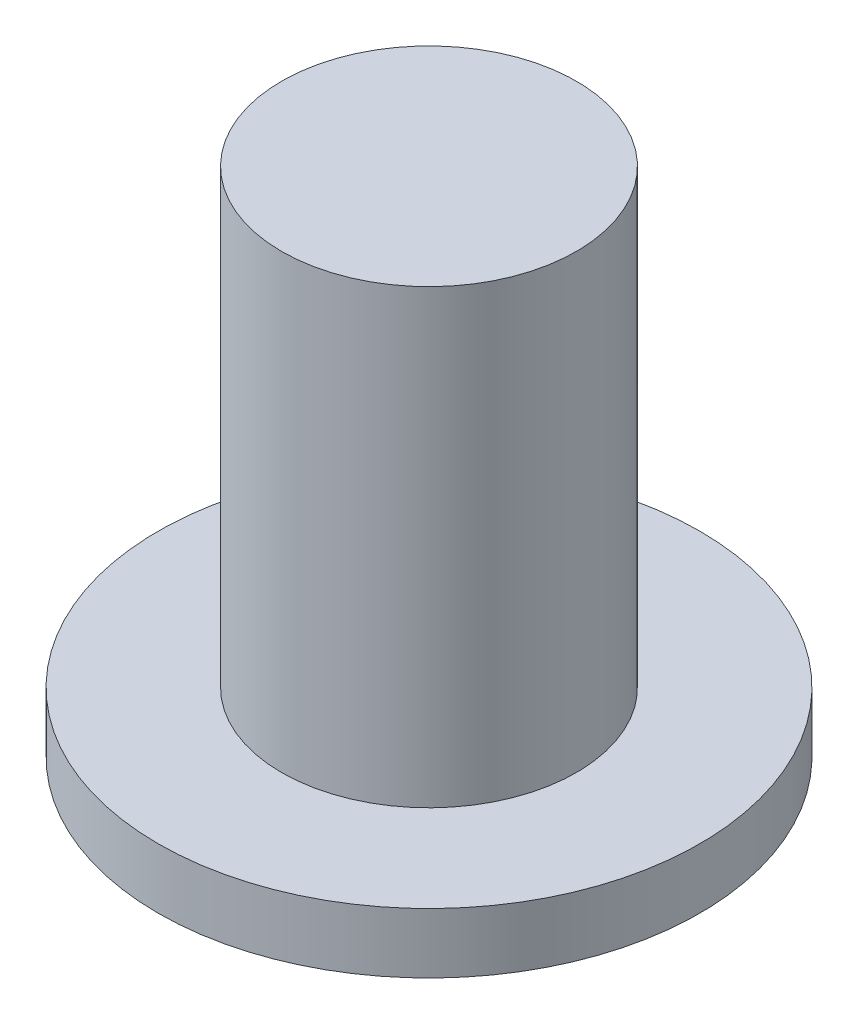
ISO-10303-21;
HEADER;
FILE_DESCRIPTION(('STEP AP214'),'2;1');
FILE_NAME('part.step','',(''),(''),'','','');
FILE_SCHEMA(('AUTOMOTIVE_DESIGN { 1 0 10303 214 1 1 1 1 }'));
ENDSEC;
DATA;
#1=APPLICATION_CONTEXT('core data for automotive mechanical design processes');
#2=APPLICATION_PROTOCOL_DEFINITION('international standard','automotive_design',2000,#1);
#3=PRODUCT_CONTEXT('',#1,'mechanical');
#4=PRODUCT('Part','Part','',(#3));
#5=PRODUCT_RELATED_PRODUCT_CATEGORY('part','',(#4));
#6=PRODUCT_DEFINITION_FORMATION('','',#4);
#7=PRODUCT_DEFINITION_CONTEXT('part definition',#1,'design');
#8=PRODUCT_DEFINITION('design','',#6,#7);
#9=PRODUCT_DEFINITION_SHAPE('','',#8);
#10=(LENGTH_UNIT() NAMED_UNIT(*) SI_UNIT(.MILLI.,.METRE.));
#11=(NAMED_UNIT(*) PLANE_ANGLE_UNIT() SI_UNIT($,.RADIAN.));
#12=(NAMED_UNIT(*) SI_UNIT($,.STERADIAN.) SOLID_ANGLE_UNIT());
#13=UNCERTAINTY_MEASURE_WITH_UNIT(LENGTH_MEASURE(1.E-05),#10,'distance_accuracy_value','');
#14=(GEOMETRIC_REPRESENTATION_CONTEXT(3) GLOBAL_UNCERTAINTY_ASSIGNED_CONTEXT((#13)) GLOBAL_UNIT_ASSIGNED_CONTEXT((#10,
#11,#12)) REPRESENTATION_CONTEXT('',''));
#15=CARTESIAN_POINT('',(0.,0.,0.));
#16=DIRECTION('',(0.,0.,1.));
#17=DIRECTION('',(1.,0.,0.));
#18=AXIS2_PLACEMENT_3D('',#15,#16,#17);
#19=CARTESIAN_POINT('',(0.,2.,0.));
#20=DIRECTION('',(0.,1.,0.));
#21=DIRECTION('',(0.,0.,1.));
#22=AXIS2_PLACEMENT_3D('',#19,#20,#21);
#23=PLANE('',#22);
#24=CARTESIAN_POINT('',(0.,2.,0.));
#25=DIRECTION('',(0.,1.,0.));
#26=DIRECTION('',(0.,0.,1.));
#27=AXIS2_PLACEMENT_3D('',#24,#25,#26);
#28=CIRCLE('',#27,9.);
#29=CARTESIAN_POINT('',(0.,2.,9.));
#30=VERTEX_POINT('',#29);
#31=EDGE_CURVE('E10',#30,#30,#28,.T.);
#32=ORIENTED_EDGE('',*,*,#31,.T.);
#33=EDGE_LOOP('',(#32));
#34=FACE_BOUND('',#33,.T.);
#35=CARTESIAN_POINT('',(0.,2.,0.));
#36=DIRECTION('',(0.,1.,0.));
#37=DIRECTION('',(0.,0.,1.));
#38=AXIS2_PLACEMENT_3D('',#35,#36,#37);
#39=CIRCLE('',#38,4.9);
#40=CARTESIAN_POINT('',(0.,2.,4.9));
#41=VERTEX_POINT('',#40);
#42=EDGE_CURVE('E48',#41,#41,#39,.T.);
#43=ORIENTED_EDGE('',*,*,#42,.F.);
#44=EDGE_LOOP('',(#43));
#45=FACE_BOUND('',#44,.T.);
#46=ADVANCED_FACE('F35',(#34,#45),#23,.T.);
#47=CARTESIAN_POINT('',(0.,2.,0.));
#48=DIRECTION('',(0.,-1.,0.));
#49=DIRECTION('',(0.,0.,-1.));
#50=AXIS2_PLACEMENT_3D('',#47,#48,#49);
#51=CYLINDRICAL_SURFACE('',#50,9.);
#52=ORIENTED_EDGE('',*,*,#31,.F.);
#53=EDGE_LOOP('',(#52));
#54=FACE_BOUND('',#53,.T.);
#55=CARTESIAN_POINT('',(0.,0.,0.));
#56=DIRECTION('',(0.,1.,0.));
#57=DIRECTION('',(0.,0.,1.));
#58=AXIS2_PLACEMENT_3D('',#55,#56,#57);
#59=CIRCLE('',#58,9.);
#60=CARTESIAN_POINT('',(0.,0.,9.));
#61=VERTEX_POINT('',#60);
#62=EDGE_CURVE('E39',#61,#61,#59,.T.);
#63=ORIENTED_EDGE('',*,*,#62,.T.);
#64=EDGE_LOOP('',(#63));
#65=FACE_BOUND('',#64,.T.);
#66=ADVANCED_FACE('F37',(#54,#65),#51,.T.);
#67=CARTESIAN_POINT('',(0.,0.,0.));
#68=DIRECTION('',(0.,1.,0.));
#69=DIRECTION('',(0.,0.,1.));
#70=AXIS2_PLACEMENT_3D('',#67,#68,#69);
#71=PLANE('',#70);
#72=ORIENTED_EDGE('',*,*,#62,.F.);
#73=EDGE_LOOP('',(#72));
#74=FACE_BOUND('',#73,.T.);
#75=ADVANCED_FACE('F59',(#74),#71,.F.);
#76=CARTESIAN_POINT('',(0.,17.,0.));
#77=DIRECTION('',(0.,-1.,0.));
#78=DIRECTION('',(0.,0.,-1.));
#79=AXIS2_PLACEMENT_3D('',#76,#77,#78);
#80=CYLINDRICAL_SURFACE('',#79,4.9);
#81=CARTESIAN_POINT('',(0.,17.,0.));
#82=DIRECTION('',(0.,1.,0.));
#83=DIRECTION('',(0.,0.,1.));
#84=AXIS2_PLACEMENT_3D('',#81,#82,#83);
#85=CIRCLE('',#84,4.9);
#86=CARTESIAN_POINT('',(0.,17.,4.9));
#87=VERTEX_POINT('',#86);
#88=EDGE_CURVE('E46',#87,#87,#85,.T.);
#89=ORIENTED_EDGE('',*,*,#88,.F.);
#90=EDGE_LOOP('',(#89));
#91=FACE_BOUND('',#90,.T.);
#92=ORIENTED_EDGE('',*,*,#42,.T.);
#93=EDGE_LOOP('',(#92));
#94=FACE_BOUND('',#93,.T.);
#95=ADVANCED_FACE('F56',(#91,#94),#80,.T.);
#96=CARTESIAN_POINT('',(0.,17.,0.));
#97=DIRECTION('',(0.,1.,0.));
#98=DIRECTION('',(0.,0.,1.));
#99=AXIS2_PLACEMENT_3D('',#96,#97,#98);
#100=PLANE('',#99);
#101=ORIENTED_EDGE('',*,*,#88,.T.);
#102=EDGE_LOOP('',(#101));
#103=FACE_BOUND('',#102,.T.);
#104=ADVANCED_FACE('F54',(#103),#100,.T.);
#105=CLOSED_SHELL('',(#46,#66,#75,#95,#104));
#106=MANIFOLD_SOLID_BREP('B2',#105);
#107=ADVANCED_BREP_SHAPE_REPRESENTATION('',(#18,#106),#14);
#108=SHAPE_DEFINITION_REPRESENTATION(#9,#107);
ENDSEC;
END-ISO-10303-21;
